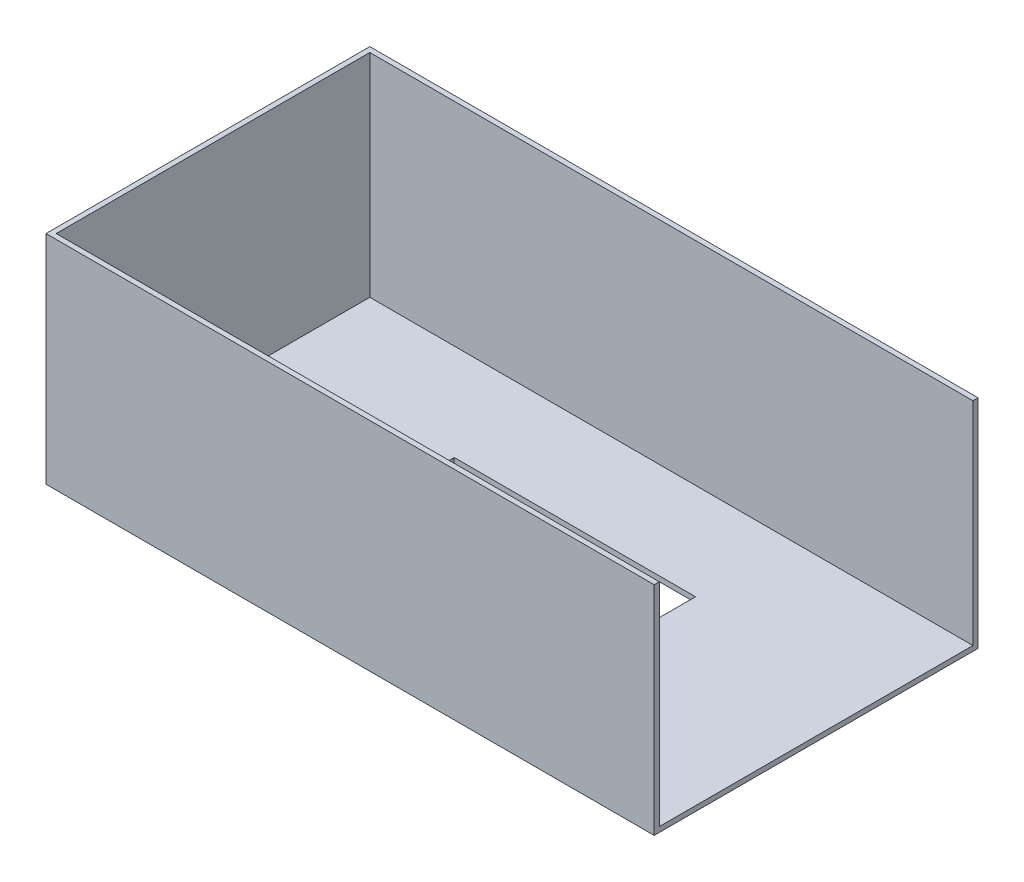
ISO-10303-21;
HEADER;
FILE_DESCRIPTION(('STEP AP214'),'2;1');
FILE_NAME('part.step','',(''),(''),'','','');
FILE_SCHEMA(('AUTOMOTIVE_DESIGN { 1 0 10303 214 1 1 1 1 }'));
ENDSEC;
DATA;
#1=APPLICATION_CONTEXT('core data for automotive mechanical design processes');
#2=APPLICATION_PROTOCOL_DEFINITION('international standard','automotive_design',2000,#1);
#3=PRODUCT_CONTEXT('',#1,'mechanical');
#4=PRODUCT('Part','Part','',(#3));
#5=PRODUCT_RELATED_PRODUCT_CATEGORY('part','',(#4));
#6=PRODUCT_DEFINITION_FORMATION('','',#4);
#7=PRODUCT_DEFINITION_CONTEXT('part definition',#1,'design');
#8=PRODUCT_DEFINITION('design','',#6,#7);
#9=PRODUCT_DEFINITION_SHAPE('','',#8);
#10=(LENGTH_UNIT() NAMED_UNIT(*) SI_UNIT(.MILLI.,.METRE.));
#11=(NAMED_UNIT(*) PLANE_ANGLE_UNIT() SI_UNIT($,.RADIAN.));
#12=(NAMED_UNIT(*) SI_UNIT($,.STERADIAN.) SOLID_ANGLE_UNIT());
#13=UNCERTAINTY_MEASURE_WITH_UNIT(LENGTH_MEASURE(1.E-05),#10,'distance_accuracy_value','');
#14=(GEOMETRIC_REPRESENTATION_CONTEXT(3) GLOBAL_UNCERTAINTY_ASSIGNED_CONTEXT((#13)) GLOBAL_UNIT_ASSIGNED_CONTEXT((#10,
#11,#12)) REPRESENTATION_CONTEXT('',''));
#15=CARTESIAN_POINT('',(0.,0.,0.));
#16=DIRECTION('',(0.,0.,1.));
#17=DIRECTION('',(1.,0.,0.));
#18=AXIS2_PLACEMENT_3D('',#15,#16,#17);
#19=CARTESIAN_POINT('',(125.,1.0555,65.));
#20=DIRECTION('',(-1.,0.,0.));
#21=DIRECTION('',(0.,0.,1.));
#22=AXIS2_PLACEMENT_3D('',#19,#20,#21);
#23=PLANE('',#22);
#24=DIRECTION('',(0.,0.,-1.));
#25=VECTOR('',#24,1.);
#26=CARTESIAN_POINT('',(125.,-1.0555,65.));
#27=LINE('',#26,#25);
#28=CARTESIAN_POINT('',(125.,-1.0555,67.11));
#29=VERTEX_POINT('',#28);
#30=CARTESIAN_POINT('',(125.,-1.0555,-67.11));
#31=VERTEX_POINT('',#30);
#32=EDGE_CURVE('E38',#29,#31,#27,.T.);
#33=ORIENTED_EDGE('',*,*,#32,.T.);
#34=DIRECTION('',(0.,1.,0.));
#35=VECTOR('',#34,1.);
#36=CARTESIAN_POINT('',(125.,-1.0555,-67.11));
#37=LINE('',#36,#35);
#38=CARTESIAN_POINT('',(125.,88.9445,-67.11));
#39=VERTEX_POINT('',#38);
#40=EDGE_CURVE('E133',#31,#39,#37,.T.);
#41=ORIENTED_EDGE('',*,*,#40,.T.);
#42=DIRECTION('',(0.,0.,1.));
#43=VECTOR('',#42,1.);
#44=CARTESIAN_POINT('',(125.,88.9445,-67.11));
#45=LINE('',#44,#43);
#46=CARTESIAN_POINT('',(125.,88.9445,-65.));
#47=VERTEX_POINT('',#46);
#48=EDGE_CURVE('E135',#39,#47,#45,.T.);
#49=ORIENTED_EDGE('',*,*,#48,.T.);
#50=DIRECTION('',(0.,1.,0.));
#51=VECTOR('',#50,1.);
#52=CARTESIAN_POINT('',(125.,-1.0555,-65.));
#53=LINE('',#52,#51);
#54=CARTESIAN_POINT('',(125.,1.0555,-65.));
#55=VERTEX_POINT('',#54);
#56=EDGE_CURVE('E189',#55,#47,#53,.T.);
#57=ORIENTED_EDGE('',*,*,#56,.F.);
#58=DIRECTION('',(0.,0.,-1.));
#59=VECTOR('',#58,1.);
#60=CARTESIAN_POINT('',(125.,1.0555,65.));
#61=LINE('',#60,#59);
#62=CARTESIAN_POINT('',(125.,1.0555,65.));
#63=VERTEX_POINT('',#62);
#64=EDGE_CURVE('E214',#63,#55,#61,.T.);
#65=ORIENTED_EDGE('',*,*,#64,.F.);
#66=DIRECTION('',(0.,1.,0.));
#67=VECTOR('',#66,1.);
#68=CARTESIAN_POINT('',(125.,-1.0555,65.));
#69=LINE('',#68,#67);
#70=CARTESIAN_POINT('',(125.,88.9445,65.));
#71=VERTEX_POINT('',#70);
#72=EDGE_CURVE('E208',#63,#71,#69,.T.);
#73=ORIENTED_EDGE('',*,*,#72,.T.);
#74=DIRECTION('',(0.,0.,-1.));
#75=VECTOR('',#74,1.);
#76=CARTESIAN_POINT('',(125.,88.9445,67.11));
#77=LINE('',#76,#75);
#78=CARTESIAN_POINT('',(125.,88.9445,67.11));
#79=VERTEX_POINT('',#78);
#80=EDGE_CURVE('E206',#79,#71,#77,.T.);
#81=ORIENTED_EDGE('',*,*,#80,.F.);
#82=DIRECTION('',(0.,1.,0.));
#83=VECTOR('',#82,1.);
#84=CARTESIAN_POINT('',(125.,-1.0555,67.11));
#85=LINE('',#84,#83);
#86=EDGE_CURVE('E201',#29,#79,#85,.T.);
#87=ORIENTED_EDGE('',*,*,#86,.F.);
#88=EDGE_LOOP('',(#33,#41,#49,#57,#65,#73,#81,#87));
#89=FACE_BOUND('',#88,.T.);
#90=ADVANCED_FACE('F35',(#89),#23,.F.);
#91=CARTESIAN_POINT('',(0.,1.0555,0.));
#92=DIRECTION('',(0.,-1.,0.));
#93=DIRECTION('',(0.,0.,-1.));
#94=AXIS2_PLACEMENT_3D('',#91,#92,#93);
#95=PLANE('',#94);
#96=DIRECTION('',(0.,0.,-1.));
#97=VECTOR('',#96,1.);
#98=CARTESIAN_POINT('',(50.,1.0555,-25.));
#99=LINE('',#98,#97);
#100=CARTESIAN_POINT('',(50.,1.0555,25.));
#101=VERTEX_POINT('',#100);
#102=CARTESIAN_POINT('',(50.,1.0555,-25.));
#103=VERTEX_POINT('',#102);
#104=EDGE_CURVE('E161',#101,#103,#99,.T.);
#105=ORIENTED_EDGE('',*,*,#104,.F.);
#106=DIRECTION('',(1.,0.,0.));
#107=VECTOR('',#106,1.);
#108=CARTESIAN_POINT('',(50.,1.0555,25.));
#109=LINE('',#108,#107);
#110=CARTESIAN_POINT('',(-50.,1.0555,25.));
#111=VERTEX_POINT('',#110);
#112=EDGE_CURVE('E164',#111,#101,#109,.T.);
#113=ORIENTED_EDGE('',*,*,#112,.F.);
#114=DIRECTION('',(0.,0.,1.));
#115=VECTOR('',#114,1.);
#116=CARTESIAN_POINT('',(-50.,1.0555,-25.));
#117=LINE('',#116,#115);
#118=CARTESIAN_POINT('',(-50.,1.0555,-25.));
#119=VERTEX_POINT('',#118);
#120=EDGE_CURVE('E157',#119,#111,#117,.T.);
#121=ORIENTED_EDGE('',*,*,#120,.F.);
#122=DIRECTION('',(-1.,0.,0.));
#123=VECTOR('',#122,1.);
#124=CARTESIAN_POINT('',(50.,1.0555,-25.));
#125=LINE('',#124,#123);
#126=EDGE_CURVE('E50',#103,#119,#125,.T.);
#127=ORIENTED_EDGE('',*,*,#126,.F.);
#128=EDGE_LOOP('',(#105,#113,#121,#127));
#129=FACE_BOUND('',#128,.T.);
#130=ORIENTED_EDGE('',*,*,#64,.T.);
#131=DIRECTION('',(-1.,0.,0.));
#132=VECTOR('',#131,1.);
#133=CARTESIAN_POINT('',(-125.,1.0555,-65.));
#134=LINE('',#133,#132);
#135=CARTESIAN_POINT('',(-125.,1.0555,-65.));
#136=VERTEX_POINT('',#135);
#137=EDGE_CURVE('E217',#55,#136,#134,.T.);
#138=ORIENTED_EDGE('',*,*,#137,.T.);
#139=DIRECTION('',(0.,0.,1.));
#140=VECTOR('',#139,1.);
#141=CARTESIAN_POINT('',(-125.,1.0555,65.));
#142=LINE('',#141,#140);
#143=CARTESIAN_POINT('',(-125.,1.0555,65.));
#144=VERTEX_POINT('',#143);
#145=EDGE_CURVE('E43',#136,#144,#142,.T.);
#146=ORIENTED_EDGE('',*,*,#145,.T.);
#147=DIRECTION('',(1.,0.,0.));
#148=VECTOR('',#147,1.);
#149=CARTESIAN_POINT('',(-125.,1.0555,65.));
#150=LINE('',#149,#148);
#151=EDGE_CURVE('E11',#144,#63,#150,.T.);
#152=ORIENTED_EDGE('',*,*,#151,.T.);
#153=EDGE_LOOP('',(#130,#138,#146,#152));
#154=FACE_BOUND('',#153,.T.);
#155=ADVANCED_FACE('F222',(#129,#154),#95,.F.);
#156=CARTESIAN_POINT('',(0.,-1.0555,0.));
#157=DIRECTION('',(0.,-1.,0.));
#158=DIRECTION('',(0.,0.,-1.));
#159=AXIS2_PLACEMENT_3D('',#156,#157,#158);
#160=PLANE('',#159);
#161=DIRECTION('',(1.,0.,0.));
#162=VECTOR('',#161,1.);
#163=CARTESIAN_POINT('',(50.,-1.0555,25.));
#164=LINE('',#163,#162);
#165=CARTESIAN_POINT('',(-50.,-1.0555,25.));
#166=VERTEX_POINT('',#165);
#167=CARTESIAN_POINT('',(50.,-1.05550000000003,25.));
#168=VERTEX_POINT('',#167);
#169=EDGE_CURVE('E160',#166,#168,#164,.T.);
#170=ORIENTED_EDGE('',*,*,#169,.T.);
#171=DIRECTION('',(0.,0.,-1.));
#172=VECTOR('',#171,1.);
#173=CARTESIAN_POINT('',(50.,-1.0555,-25.));
#174=LINE('',#173,#172);
#175=CARTESIAN_POINT('',(50.,-1.0555,-25.));
#176=VERTEX_POINT('',#175);
#177=EDGE_CURVE('E179',#168,#176,#174,.T.);
#178=ORIENTED_EDGE('',*,*,#177,.T.);
#179=DIRECTION('',(-1.,0.,0.));
#180=VECTOR('',#179,1.);
#181=CARTESIAN_POINT('',(50.,-1.0555,-25.));
#182=LINE('',#181,#180);
#183=CARTESIAN_POINT('',(-50.,-1.0555,-25.));
#184=VERTEX_POINT('',#183);
#185=EDGE_CURVE('E175',#176,#184,#182,.T.);
#186=ORIENTED_EDGE('',*,*,#185,.T.);
#187=DIRECTION('',(0.,0.,1.));
#188=VECTOR('',#187,1.);
#189=CARTESIAN_POINT('',(-50.,-1.0555,-25.));
#190=LINE('',#189,#188);
#191=EDGE_CURVE('E171',#184,#166,#190,.T.);
#192=ORIENTED_EDGE('',*,*,#191,.T.);
#193=EDGE_LOOP('',(#170,#178,#186,#192));
#194=FACE_BOUND('',#193,.T.);
#195=ORIENTED_EDGE('',*,*,#32,.F.);
#196=DIRECTION('',(1.,0.,0.));
#197=VECTOR('',#196,1.);
#198=CARTESIAN_POINT('',(-125.,-1.0555,67.11));
#199=LINE('',#198,#197);
#200=CARTESIAN_POINT('',(-127.11,-1.0555,67.11));
#201=VERTEX_POINT('',#200);
#202=EDGE_CURVE('E141',#201,#29,#199,.T.);
#203=ORIENTED_EDGE('',*,*,#202,.F.);
#204=DIRECTION('',(0.,0.,1.));
#205=VECTOR('',#204,1.);
#206=CARTESIAN_POINT('',(-127.11,-1.0555,-67.11));
#207=LINE('',#206,#205);
#208=CARTESIAN_POINT('',(-127.11,-1.0555,-67.11));
#209=VERTEX_POINT('',#208);
#210=EDGE_CURVE('E138',#209,#201,#207,.T.);
#211=ORIENTED_EDGE('',*,*,#210,.F.);
#212=DIRECTION('',(1.,0.,0.));
#213=VECTOR('',#212,1.);
#214=CARTESIAN_POINT('',(-125.,-1.0555,-67.11));
#215=LINE('',#214,#213);
#216=EDGE_CURVE('E126',#209,#31,#215,.T.);
#217=ORIENTED_EDGE('',*,*,#216,.T.);
#218=EDGE_LOOP('',(#195,#203,#211,#217));
#219=FACE_BOUND('',#218,.T.);
#220=ADVANCED_FACE('F139',(#194,#219),#160,.T.);
#221=CARTESIAN_POINT('',(0.,0.,65.));
#222=DIRECTION('',(0.,0.,-1.));
#223=DIRECTION('',(-1.,0.,0.));
#224=AXIS2_PLACEMENT_3D('',#221,#222,#223);
#225=PLANE('',#224);
#226=ORIENTED_EDGE('',*,*,#151,.F.);
#227=DIRECTION('',(0.,-1.,0.));
#228=VECTOR('',#227,1.);
#229=CARTESIAN_POINT('',(-125.,-1.0555,65.));
#230=LINE('',#229,#228);
#231=CARTESIAN_POINT('',(-125.,88.9445,65.));
#232=VERTEX_POINT('',#231);
#233=EDGE_CURVE('E199',#232,#144,#230,.T.);
#234=ORIENTED_EDGE('',*,*,#233,.F.);
#235=DIRECTION('',(-1.,0.,0.));
#236=VECTOR('',#235,1.);
#237=CARTESIAN_POINT('',(-125.,88.9445,65.));
#238=LINE('',#237,#236);
#239=EDGE_CURVE('E202',#71,#232,#238,.T.);
#240=ORIENTED_EDGE('',*,*,#239,.F.);
#241=ORIENTED_EDGE('',*,*,#72,.F.);
#242=EDGE_LOOP('',(#226,#234,#240,#241));
#243=FACE_BOUND('',#242,.T.);
#244=ADVANCED_FACE('F238',(#243),#225,.T.);
#245=CARTESIAN_POINT('',(-125.,88.9445,67.11));
#246=DIRECTION('',(0.,-1.,0.));
#247=DIRECTION('',(0.,0.,-1.));
#248=AXIS2_PLACEMENT_3D('',#245,#246,#247);
#249=PLANE('',#248);
#250=ORIENTED_EDGE('',*,*,#239,.T.);
#251=DIRECTION('',(0.,0.,-1.));
#252=VECTOR('',#251,1.);
#253=CARTESIAN_POINT('',(-125.,88.9445,-67.11));
#254=LINE('',#253,#252);
#255=CARTESIAN_POINT('',(-125.,88.9445,-65.));
#256=VERTEX_POINT('',#255);
#257=EDGE_CURVE('E151',#232,#256,#254,.T.);
#258=ORIENTED_EDGE('',*,*,#257,.T.);
#259=DIRECTION('',(-1.,0.,0.));
#260=VECTOR('',#259,1.);
#261=CARTESIAN_POINT('',(-125.,88.9445,-65.));
#262=LINE('',#261,#260);
#263=EDGE_CURVE('E193',#47,#256,#262,.T.);
#264=ORIENTED_EDGE('',*,*,#263,.F.);
#265=ORIENTED_EDGE('',*,*,#48,.F.);
#266=DIRECTION('',(-1.,0.,0.));
#267=VECTOR('',#266,1.);
#268=CARTESIAN_POINT('',(-125.,88.9445,-67.11));
#269=LINE('',#268,#267);
#270=CARTESIAN_POINT('',(-127.11,88.9445,-67.11));
#271=VERTEX_POINT('',#270);
#272=EDGE_CURVE('E187',#39,#271,#269,.T.);
#273=ORIENTED_EDGE('',*,*,#272,.T.);
#274=DIRECTION('',(0.,0.,-1.));
#275=VECTOR('',#274,1.);
#276=CARTESIAN_POINT('',(-127.11,88.9445,-67.11));
#277=LINE('',#276,#275);
#278=CARTESIAN_POINT('',(-127.11,88.9445,67.11));
#279=VERTEX_POINT('',#278);
#280=EDGE_CURVE('E150',#279,#271,#277,.T.);
#281=ORIENTED_EDGE('',*,*,#280,.F.);
#282=DIRECTION('',(-1.,0.,0.));
#283=VECTOR('',#282,1.);
#284=CARTESIAN_POINT('',(-125.,88.9445,67.11));
#285=LINE('',#284,#283);
#286=EDGE_CURVE('E204',#79,#279,#285,.T.);
#287=ORIENTED_EDGE('',*,*,#286,.F.);
#288=ORIENTED_EDGE('',*,*,#80,.T.);
#289=EDGE_LOOP('',(#250,#258,#264,#265,#273,#281,#287,#288));
#290=FACE_BOUND('',#289,.T.);
#291=ADVANCED_FACE('F233',(#290),#249,.F.);
#292=CARTESIAN_POINT('',(0.,0.,67.11));
#293=DIRECTION('',(0.,0.,-1.));
#294=DIRECTION('',(-1.,0.,0.));
#295=AXIS2_PLACEMENT_3D('',#292,#293,#294);
#296=PLANE('',#295);
#297=ORIENTED_EDGE('',*,*,#286,.T.);
#298=DIRECTION('',(0.,1.,0.));
#299=VECTOR('',#298,1.);
#300=CARTESIAN_POINT('',(-127.11,88.9445,67.11));
#301=LINE('',#300,#299);
#302=EDGE_CURVE('E145',#201,#279,#301,.T.);
#303=ORIENTED_EDGE('',*,*,#302,.F.);
#304=ORIENTED_EDGE('',*,*,#202,.T.);
#305=ORIENTED_EDGE('',*,*,#86,.T.);
#306=EDGE_LOOP('',(#297,#303,#304,#305));
#307=FACE_BOUND('',#306,.T.);
#308=ADVANCED_FACE('F242',(#307),#296,.F.);
#309=CARTESIAN_POINT('',(0.,0.,-65.));
#310=DIRECTION('',(0.,0.,1.));
#311=DIRECTION('',(-1.,0.,0.));
#312=AXIS2_PLACEMENT_3D('',#309,#310,#311);
#313=PLANE('',#312);
#314=ORIENTED_EDGE('',*,*,#137,.F.);
#315=ORIENTED_EDGE('',*,*,#56,.T.);
#316=ORIENTED_EDGE('',*,*,#263,.T.);
#317=DIRECTION('',(0.,-1.,0.));
#318=VECTOR('',#317,1.);
#319=CARTESIAN_POINT('',(-125.,-1.0555,-65.));
#320=LINE('',#319,#318);
#321=EDGE_CURVE('E186',#256,#136,#320,.T.);
#322=ORIENTED_EDGE('',*,*,#321,.T.);
#323=EDGE_LOOP('',(#314,#315,#316,#322));
#324=FACE_BOUND('',#323,.T.);
#325=ADVANCED_FACE('F229',(#324),#313,.T.);
#326=CARTESIAN_POINT('',(0.,0.,-67.11));
#327=DIRECTION('',(0.,0.,1.));
#328=DIRECTION('',(-1.,0.,0.));
#329=AXIS2_PLACEMENT_3D('',#326,#327,#328);
#330=PLANE('',#329);
#331=ORIENTED_EDGE('',*,*,#216,.F.);
#332=DIRECTION('',(0.,-1.,0.));
#333=VECTOR('',#332,1.);
#334=CARTESIAN_POINT('',(-127.11,88.9445,-67.11));
#335=LINE('',#334,#333);
#336=EDGE_CURVE('E131',#271,#209,#335,.T.);
#337=ORIENTED_EDGE('',*,*,#336,.F.);
#338=ORIENTED_EDGE('',*,*,#272,.F.);
#339=ORIENTED_EDGE('',*,*,#40,.F.);
#340=EDGE_LOOP('',(#331,#337,#338,#339));
#341=FACE_BOUND('',#340,.T.);
#342=ADVANCED_FACE('F128',(#341),#330,.F.);
#343=CARTESIAN_POINT('',(50.,-112.85889887499,25.));
#344=DIRECTION('',(0.,0.,1.));
#345=DIRECTION('',(1.,0.,0.));
#346=AXIS2_PLACEMENT_3D('',#343,#344,#345);
#347=PLANE('',#346);
#348=DIRECTION('',(0.,1.,0.));
#349=VECTOR('',#348,1.);
#350=CARTESIAN_POINT('',(-50.,-112.85889887499,25.));
#351=LINE('',#350,#349);
#352=EDGE_CURVE('E58',#166,#111,#351,.T.);
#353=ORIENTED_EDGE('',*,*,#352,.T.);
#354=ORIENTED_EDGE('',*,*,#112,.T.);
#355=DIRECTION('',(0.,1.,0.));
#356=VECTOR('',#355,1.);
#357=CARTESIAN_POINT('',(50.,-112.85889887499,25.));
#358=LINE('',#357,#356);
#359=EDGE_CURVE('E170',#168,#101,#358,.T.);
#360=ORIENTED_EDGE('',*,*,#359,.F.);
#361=ORIENTED_EDGE('',*,*,#169,.F.);
#362=EDGE_LOOP('',(#353,#354,#360,#361));
#363=FACE_BOUND('',#362,.T.);
#364=ADVANCED_FACE('F294',(#363),#347,.F.);
#365=CARTESIAN_POINT('',(50.,-112.85889887499,-25.));
#366=DIRECTION('',(1.,0.,0.));
#367=DIRECTION('',(0.,0.,-1.));
#368=AXIS2_PLACEMENT_3D('',#365,#366,#367);
#369=PLANE('',#368);
#370=ORIENTED_EDGE('',*,*,#359,.T.);
#371=ORIENTED_EDGE('',*,*,#104,.T.);
#372=DIRECTION('',(0.,1.,0.));
#373=VECTOR('',#372,1.);
#374=CARTESIAN_POINT('',(50.,-112.85889887499,-25.));
#375=LINE('',#374,#373);
#376=EDGE_CURVE('E178',#176,#103,#375,.T.);
#377=ORIENTED_EDGE('',*,*,#376,.F.);
#378=ORIENTED_EDGE('',*,*,#177,.F.);
#379=EDGE_LOOP('',(#370,#371,#377,#378));
#380=FACE_BOUND('',#379,.T.);
#381=ADVANCED_FACE('F322',(#380),#369,.F.);
#382=CARTESIAN_POINT('',(50.,-112.85889887499,-25.));
#383=DIRECTION('',(0.,0.,-1.));
#384=DIRECTION('',(-1.,0.,0.));
#385=AXIS2_PLACEMENT_3D('',#382,#383,#384);
#386=PLANE('',#385);
#387=ORIENTED_EDGE('',*,*,#376,.T.);
#388=ORIENTED_EDGE('',*,*,#126,.T.);
#389=DIRECTION('',(0.,1.,0.));
#390=VECTOR('',#389,1.);
#391=CARTESIAN_POINT('',(-50.,-112.85889887499,-25.));
#392=LINE('',#391,#390);
#393=EDGE_CURVE('E174',#184,#119,#392,.T.);
#394=ORIENTED_EDGE('',*,*,#393,.F.);
#395=ORIENTED_EDGE('',*,*,#185,.F.);
#396=EDGE_LOOP('',(#387,#388,#394,#395));
#397=FACE_BOUND('',#396,.T.);
#398=ADVANCED_FACE('F319',(#397),#386,.F.);
#399=CARTESIAN_POINT('',(-50.,-112.85889887499,-25.));
#400=DIRECTION('',(-1.,0.,0.));
#401=DIRECTION('',(0.,0.,1.));
#402=AXIS2_PLACEMENT_3D('',#399,#400,#401);
#403=PLANE('',#402);
#404=ORIENTED_EDGE('',*,*,#393,.T.);
#405=ORIENTED_EDGE('',*,*,#120,.T.);
#406=ORIENTED_EDGE('',*,*,#352,.F.);
#407=ORIENTED_EDGE('',*,*,#191,.F.);
#408=EDGE_LOOP('',(#404,#405,#406,#407));
#409=FACE_BOUND('',#408,.T.);
#410=ADVANCED_FACE('F304',(#409),#403,.F.);
#411=CARTESIAN_POINT('',(-125.,0.,0.));
#412=DIRECTION('',(-1.,0.,0.));
#413=DIRECTION('',(0.,0.,1.));
#414=AXIS2_PLACEMENT_3D('',#411,#412,#413);
#415=PLANE('',#414);
#416=ORIENTED_EDGE('',*,*,#257,.F.);
#417=ORIENTED_EDGE('',*,*,#233,.T.);
#418=ORIENTED_EDGE('',*,*,#145,.F.);
#419=ORIENTED_EDGE('',*,*,#321,.F.);
#420=EDGE_LOOP('',(#416,#417,#418,#419));
#421=FACE_BOUND('',#420,.T.);
#422=ADVANCED_FACE('F226',(#421),#415,.F.);
#423=CARTESIAN_POINT('',(-127.11,0.,0.));
#424=DIRECTION('',(-1.,0.,0.));
#425=DIRECTION('',(0.,0.,1.));
#426=AXIS2_PLACEMENT_3D('',#423,#424,#425);
#427=PLANE('',#426);
#428=ORIENTED_EDGE('',*,*,#336,.T.);
#429=ORIENTED_EDGE('',*,*,#210,.T.);
#430=ORIENTED_EDGE('',*,*,#302,.T.);
#431=ORIENTED_EDGE('',*,*,#280,.T.);
#432=EDGE_LOOP('',(#428,#429,#430,#431));
#433=FACE_BOUND('',#432,.T.);
#434=ADVANCED_FACE('F148',(#433),#427,.T.);
#435=CLOSED_SHELL('',(#90,#155,#220,#244,#291,#308,#325,#342,#364,#381,#398,#410,#422,#434));
#436=MANIFOLD_SOLID_BREP('B2',#435);
#437=ADVANCED_BREP_SHAPE_REPRESENTATION('',(#18,#436),#14);
#438=SHAPE_DEFINITION_REPRESENTATION(#9,#437);
ENDSEC;
END-ISO-10303-21;
